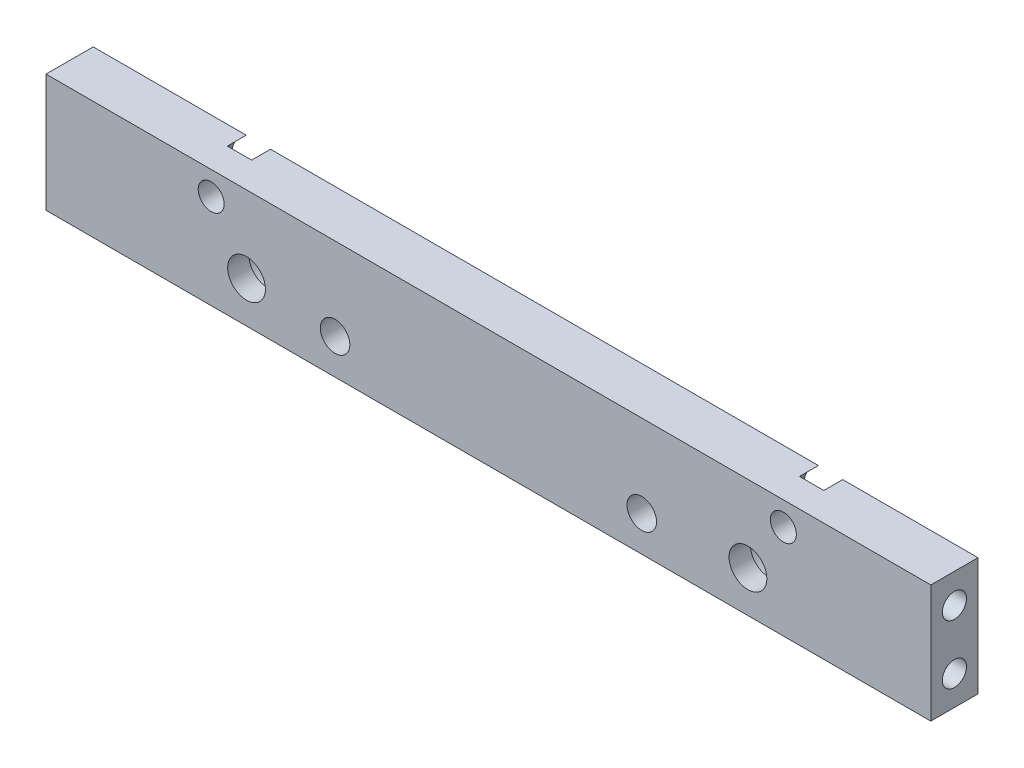
ISO-10303-21;
HEADER;
FILE_DESCRIPTION(('STEP AP214'),'2;1');
FILE_NAME('part.step','',(''),(''),'','','');
FILE_SCHEMA(('AUTOMOTIVE_DESIGN { 1 0 10303 214 1 1 1 1 }'));
ENDSEC;
DATA;
#1=APPLICATION_CONTEXT('core data for automotive mechanical design processes');
#2=APPLICATION_PROTOCOL_DEFINITION('international standard','automotive_design',2000,#1);
#3=PRODUCT_CONTEXT('',#1,'mechanical');
#4=PRODUCT('Part','Part','',(#3));
#5=PRODUCT_RELATED_PRODUCT_CATEGORY('part','',(#4));
#6=PRODUCT_DEFINITION_FORMATION('','',#4);
#7=PRODUCT_DEFINITION_CONTEXT('part definition',#1,'design');
#8=PRODUCT_DEFINITION('design','',#6,#7);
#9=PRODUCT_DEFINITION_SHAPE('','',#8);
#10=(LENGTH_UNIT() NAMED_UNIT(*) SI_UNIT(.MILLI.,.METRE.));
#11=(NAMED_UNIT(*) PLANE_ANGLE_UNIT() SI_UNIT($,.RADIAN.));
#12=(NAMED_UNIT(*) SI_UNIT($,.STERADIAN.) SOLID_ANGLE_UNIT());
#13=UNCERTAINTY_MEASURE_WITH_UNIT(LENGTH_MEASURE(1.E-05),#10,'distance_accuracy_value','');
#14=(GEOMETRIC_REPRESENTATION_CONTEXT(3) GLOBAL_UNCERTAINTY_ASSIGNED_CONTEXT((#13)) GLOBAL_UNIT_ASSIGNED_CONTEXT((#10,
#11,#12)) REPRESENTATION_CONTEXT('',''));
#15=CARTESIAN_POINT('',(0.,0.,0.));
#16=DIRECTION('',(0.,0.,1.));
#17=DIRECTION('',(1.,0.,0.));
#18=AXIS2_PLACEMENT_3D('',#15,#16,#17);
#19=CARTESIAN_POINT('',(-37.5,-5.,0.));
#20=DIRECTION('',(0.,-1.,0.));
#21=DIRECTION('',(0.,0.,-1.));
#22=AXIS2_PLACEMENT_3D('',#19,#20,#21);
#23=PLANE('',#22);
#24=DIRECTION('',(1.,0.,0.));
#25=VECTOR('',#24,1.);
#26=CARTESIAN_POINT('',(-37.5,-5.,4.));
#27=LINE('',#26,#25);
#28=CARTESIAN_POINT('',(-37.5,-5.,4.));
#29=VERTEX_POINT('',#28);
#30=CARTESIAN_POINT('',(37.5,-5.,4.));
#31=VERTEX_POINT('',#30);
#32=EDGE_CURVE('E200',#29,#31,#27,.T.);
#33=ORIENTED_EDGE('',*,*,#32,.F.);
#34=DIRECTION('',(0.,0.,1.));
#35=VECTOR('',#34,1.);
#36=CARTESIAN_POINT('',(-37.5,-5.,0.));
#37=LINE('',#36,#35);
#38=CARTESIAN_POINT('',(-37.5,-5.,0.));
#39=VERTEX_POINT('',#38);
#40=EDGE_CURVE('E227',#39,#29,#37,.T.);
#41=ORIENTED_EDGE('',*,*,#40,.F.);
#42=DIRECTION('',(1.,0.,0.));
#43=VECTOR('',#42,1.);
#44=CARTESIAN_POINT('',(-37.5,-5.,0.));
#45=LINE('',#44,#43);
#46=CARTESIAN_POINT('',(37.5,-5.,0.));
#47=VERTEX_POINT('',#46);
#48=EDGE_CURVE('E201',#39,#47,#45,.T.);
#49=ORIENTED_EDGE('',*,*,#48,.T.);
#50=DIRECTION('',(0.,0.,1.));
#51=VECTOR('',#50,1.);
#52=CARTESIAN_POINT('',(37.5,-5.,0.));
#53=LINE('',#52,#51);
#54=EDGE_CURVE('E216',#47,#31,#53,.T.);
#55=ORIENTED_EDGE('',*,*,#54,.T.);
#56=EDGE_LOOP('',(#33,#41,#49,#55));
#57=FACE_BOUND('',#56,.T.);
#58=ADVANCED_FACE('F32',(#57),#23,.T.);
#59=CARTESIAN_POINT('',(-37.5,5.,0.));
#60=DIRECTION('',(-1.,0.,0.));
#61=DIRECTION('',(0.,0.,1.));
#62=AXIS2_PLACEMENT_3D('',#59,#60,#61);
#63=PLANE('',#62);
#64=CARTESIAN_POINT('',(-37.5,-2.49999999999999,2.));
#65=DIRECTION('',(-1.,0.,0.));
#66=DIRECTION('',(0.,0.,1.));
#67=AXIS2_PLACEMENT_3D('',#64,#65,#66);
#68=CIRCLE('',#67,1.02499999999999);
#69=CARTESIAN_POINT('',(-37.5,-2.49999999999999,3.02499999999999));
#70=VERTEX_POINT('',#69);
#71=EDGE_CURVE('E118',#70,#70,#68,.T.);
#72=ORIENTED_EDGE('',*,*,#71,.F.);
#73=EDGE_LOOP('',(#72));
#74=FACE_BOUND('',#73,.T.);
#75=CARTESIAN_POINT('',(-37.5,2.50000000000001,2.));
#76=DIRECTION('',(-1.,0.,0.));
#77=DIRECTION('',(0.,0.,1.));
#78=AXIS2_PLACEMENT_3D('',#75,#76,#77);
#79=CIRCLE('',#78,1.02499999999999);
#80=CARTESIAN_POINT('',(-37.5,2.50000000000001,3.02499999999999));
#81=VERTEX_POINT('',#80);
#82=EDGE_CURVE('E117',#81,#81,#79,.T.);
#83=ORIENTED_EDGE('',*,*,#82,.F.);
#84=EDGE_LOOP('',(#83));
#85=FACE_BOUND('',#84,.T.);
#86=DIRECTION('',(0.,-1.,0.));
#87=VECTOR('',#86,1.);
#88=CARTESIAN_POINT('',(-37.5,5.,4.));
#89=LINE('',#88,#87);
#90=CARTESIAN_POINT('',(-37.5,5.,4.));
#91=VERTEX_POINT('',#90);
#92=EDGE_CURVE('E205',#91,#29,#89,.T.);
#93=ORIENTED_EDGE('',*,*,#92,.F.);
#94=DIRECTION('',(0.,0.,1.));
#95=VECTOR('',#94,1.);
#96=CARTESIAN_POINT('',(-37.5,5.,0.));
#97=LINE('',#96,#95);
#98=CARTESIAN_POINT('',(-37.5,5.,0.));
#99=VERTEX_POINT('',#98);
#100=EDGE_CURVE('E230',#99,#91,#97,.T.);
#101=ORIENTED_EDGE('',*,*,#100,.F.);
#102=DIRECTION('',(0.,-1.,0.));
#103=VECTOR('',#102,1.);
#104=CARTESIAN_POINT('',(-37.5,5.,0.));
#105=LINE('',#104,#103);
#106=EDGE_CURVE('E212',#99,#39,#105,.T.);
#107=ORIENTED_EDGE('',*,*,#106,.T.);
#108=ORIENTED_EDGE('',*,*,#40,.T.);
#109=EDGE_LOOP('',(#93,#101,#107,#108));
#110=FACE_BOUND('',#109,.T.);
#111=ADVANCED_FACE('F253',(#74,#85,#110),#63,.T.);
#112=CARTESIAN_POINT('',(37.5,5.,0.));
#113=DIRECTION('',(0.,1.,0.));
#114=DIRECTION('',(0.,0.,1.));
#115=AXIS2_PLACEMENT_3D('',#112,#113,#114);
#116=PLANE('',#115);
#117=DIRECTION('',(0.,0.,-1.));
#118=VECTOR('',#117,1.);
#119=CARTESIAN_POINT('',(-22.4692235967978,5.,0.));
#120=LINE('',#119,#118);
#121=CARTESIAN_POINT('',(-22.4692235967978,5.,1.6));
#122=VERTEX_POINT('',#121);
#123=CARTESIAN_POINT('',(-22.4692235967978,5.,0.));
#124=VERTEX_POINT('',#123);
#125=EDGE_CURVE('E46',#122,#124,#120,.T.);
#126=ORIENTED_EDGE('',*,*,#125,.F.);
#127=DIRECTION('',(1.,0.,0.));
#128=VECTOR('',#127,1.);
#129=CARTESIAN_POINT('',(37.5,5.,1.6));
#130=LINE('',#129,#128);
#131=CARTESIAN_POINT('',(-24.5307764032022,5.,1.6));
#132=VERTEX_POINT('',#131);
#133=EDGE_CURVE('E11',#132,#122,#130,.T.);
#134=ORIENTED_EDGE('',*,*,#133,.F.);
#135=DIRECTION('',(0.,0.,-1.));
#136=VECTOR('',#135,1.);
#137=CARTESIAN_POINT('',(-24.5307764032022,5.,0.));
#138=LINE('',#137,#136);
#139=CARTESIAN_POINT('',(-24.5307764032022,5.,0.));
#140=VERTEX_POINT('',#139);
#141=EDGE_CURVE('E149',#140,#132,#138,.F.);
#142=ORIENTED_EDGE('',*,*,#141,.F.);
#143=DIRECTION('',(-1.,0.,0.));
#144=VECTOR('',#143,1.);
#145=CARTESIAN_POINT('',(37.5,5.,0.));
#146=LINE('',#145,#144);
#147=EDGE_CURVE('E208',#140,#99,#146,.T.);
#148=ORIENTED_EDGE('',*,*,#147,.T.);
#149=ORIENTED_EDGE('',*,*,#100,.T.);
#150=DIRECTION('',(-1.,0.,0.));
#151=VECTOR('',#150,1.);
#152=CARTESIAN_POINT('',(37.5,5.,4.));
#153=LINE('',#152,#151);
#154=CARTESIAN_POINT('',(37.5,5.,4.));
#155=VERTEX_POINT('',#154);
#156=EDGE_CURVE('E222',#155,#91,#153,.T.);
#157=ORIENTED_EDGE('',*,*,#156,.F.);
#158=DIRECTION('',(0.,0.,1.));
#159=VECTOR('',#158,1.);
#160=CARTESIAN_POINT('',(37.5,5.,0.));
#161=LINE('',#160,#159);
#162=CARTESIAN_POINT('',(37.5,5.,0.));
#163=VERTEX_POINT('',#162);
#164=EDGE_CURVE('E232',#163,#155,#161,.T.);
#165=ORIENTED_EDGE('',*,*,#164,.F.);
#166=CARTESIAN_POINT('',(26.0307764032022,5.,0.));
#167=VERTEX_POINT('',#166);
#168=EDGE_CURVE('E209',#163,#167,#146,.T.);
#169=ORIENTED_EDGE('',*,*,#168,.T.);
#170=DIRECTION('',(0.,0.,-1.));
#171=VECTOR('',#170,1.);
#172=CARTESIAN_POINT('',(26.0307764032022,5.,0.));
#173=LINE('',#172,#171);
#174=CARTESIAN_POINT('',(26.0307764032022,5.,1.6));
#175=VERTEX_POINT('',#174);
#176=EDGE_CURVE('E54',#175,#167,#173,.T.);
#177=ORIENTED_EDGE('',*,*,#176,.F.);
#178=DIRECTION('',(1.,0.,0.));
#179=VECTOR('',#178,1.);
#180=CARTESIAN_POINT('',(37.5,5.,1.6));
#181=LINE('',#180,#179);
#182=CARTESIAN_POINT('',(23.9692235967978,5.,1.6));
#183=VERTEX_POINT('',#182);
#184=EDGE_CURVE('E236',#183,#175,#181,.T.);
#185=ORIENTED_EDGE('',*,*,#184,.F.);
#186=DIRECTION('',(0.,0.,-1.));
#187=VECTOR('',#186,1.);
#188=CARTESIAN_POINT('',(23.9692235967978,5.,0.));
#189=LINE('',#188,#187);
#190=CARTESIAN_POINT('',(23.9692235967978,5.,0.));
#191=VERTEX_POINT('',#190);
#192=EDGE_CURVE('E161',#191,#183,#189,.F.);
#193=ORIENTED_EDGE('',*,*,#192,.F.);
#194=EDGE_CURVE('E213',#191,#124,#146,.T.);
#195=ORIENTED_EDGE('',*,*,#194,.T.);
#196=EDGE_LOOP('',(#126,#134,#142,#148,#149,#157,#165,#169,#177,#185,#193,#195));
#197=FACE_BOUND('',#196,.T.);
#198=ADVANCED_FACE('F246',(#197),#116,.T.);
#199=CARTESIAN_POINT('',(37.5,-5.,0.));
#200=DIRECTION('',(1.,0.,0.));
#201=DIRECTION('',(0.,0.,-1.));
#202=AXIS2_PLACEMENT_3D('',#199,#200,#201);
#203=PLANE('',#202);
#204=CARTESIAN_POINT('',(37.5,2.50000000000001,2.));
#205=DIRECTION('',(1.,0.,0.));
#206=DIRECTION('',(0.,0.,-1.));
#207=AXIS2_PLACEMENT_3D('',#204,#205,#206);
#208=CIRCLE('',#207,1.02499999999999);
#209=CARTESIAN_POINT('',(37.5,2.50000000000001,0.975000000000011));
#210=VERTEX_POINT('',#209);
#211=EDGE_CURVE('E128',#210,#210,#208,.T.);
#212=ORIENTED_EDGE('',*,*,#211,.F.);
#213=EDGE_LOOP('',(#212));
#214=FACE_BOUND('',#213,.T.);
#215=CARTESIAN_POINT('',(37.5,-2.49999999999999,2.));
#216=DIRECTION('',(1.,0.,0.));
#217=DIRECTION('',(0.,0.,-1.));
#218=AXIS2_PLACEMENT_3D('',#215,#216,#217);
#219=CIRCLE('',#218,1.02499999999999);
#220=CARTESIAN_POINT('',(37.5,-2.49999999999999,0.975000000000011));
#221=VERTEX_POINT('',#220);
#222=EDGE_CURVE('E134',#221,#221,#219,.T.);
#223=ORIENTED_EDGE('',*,*,#222,.F.);
#224=EDGE_LOOP('',(#223));
#225=FACE_BOUND('',#224,.T.);
#226=DIRECTION('',(0.,1.,0.));
#227=VECTOR('',#226,1.);
#228=CARTESIAN_POINT('',(37.5,-5.,4.));
#229=LINE('',#228,#227);
#230=EDGE_CURVE('E219',#31,#155,#229,.T.);
#231=ORIENTED_EDGE('',*,*,#230,.F.);
#232=ORIENTED_EDGE('',*,*,#54,.F.);
#233=DIRECTION('',(0.,1.,0.));
#234=VECTOR('',#233,1.);
#235=CARTESIAN_POINT('',(37.5,-5.,0.));
#236=LINE('',#235,#234);
#237=EDGE_CURVE('E204',#47,#163,#236,.T.);
#238=ORIENTED_EDGE('',*,*,#237,.T.);
#239=ORIENTED_EDGE('',*,*,#164,.T.);
#240=EDGE_LOOP('',(#231,#232,#238,#239));
#241=FACE_BOUND('',#240,.T.);
#242=ADVANCED_FACE('F263',(#214,#225,#241),#203,.T.);
#243=CARTESIAN_POINT('',(0.,0.,0.));
#244=DIRECTION('',(0.,0.,1.));
#245=DIRECTION('',(1.,0.,0.));
#246=AXIS2_PLACEMENT_3D('',#243,#244,#245);
#247=PLANE('',#246);
#248=CARTESIAN_POINT('',(22.,-1.5,0.));
#249=DIRECTION('',(0.,0.,-1.));
#250=DIRECTION('',(-1.,0.,0.));
#251=AXIS2_PLACEMENT_3D('',#248,#249,#250);
#252=CIRCLE('',#251,2.89999999999999);
#253=CARTESIAN_POINT('',(19.1,-1.5,0.));
#254=VERTEX_POINT('',#253);
#255=EDGE_CURVE('E164',#254,#254,#252,.T.);
#256=ORIENTED_EDGE('',*,*,#255,.F.);
#257=EDGE_LOOP('',(#256));
#258=FACE_BOUND('',#257,.T.);
#259=CARTESIAN_POINT('',(-20.5,-1.5,0.));
#260=DIRECTION('',(0.,0.,-1.));
#261=DIRECTION('',(-1.,0.,0.));
#262=AXIS2_PLACEMENT_3D('',#259,#260,#261);
#263=CIRCLE('',#262,2.89999999999999);
#264=CARTESIAN_POINT('',(-23.4,-1.5,0.));
#265=VERTEX_POINT('',#264);
#266=EDGE_CURVE('E176',#265,#265,#263,.T.);
#267=ORIENTED_EDGE('',*,*,#266,.F.);
#268=EDGE_LOOP('',(#267));
#269=FACE_BOUND('',#268,.T.);
#270=CARTESIAN_POINT('',(13.,-2.,0.));
#271=DIRECTION('',(0.,0.,-1.));
#272=DIRECTION('',(-1.,0.,0.));
#273=AXIS2_PLACEMENT_3D('',#270,#271,#272);
#274=CIRCLE('',#273,1.24999999999999);
#275=CARTESIAN_POINT('',(11.75,-2.,0.));
#276=VERTEX_POINT('',#275);
#277=EDGE_CURVE('E188',#276,#276,#274,.T.);
#278=ORIENTED_EDGE('',*,*,#277,.F.);
#279=EDGE_LOOP('',(#278));
#280=FACE_BOUND('',#279,.T.);
#281=CARTESIAN_POINT('',(-13.,-2.,0.));
#282=DIRECTION('',(0.,0.,-1.));
#283=DIRECTION('',(-1.,0.,0.));
#284=AXIS2_PLACEMENT_3D('',#281,#282,#283);
#285=CIRCLE('',#284,1.24999999999999);
#286=CARTESIAN_POINT('',(-14.25,-2.,0.));
#287=VERTEX_POINT('',#286);
#288=EDGE_CURVE('E194',#287,#287,#285,.T.);
#289=ORIENTED_EDGE('',*,*,#288,.F.);
#290=EDGE_LOOP('',(#289));
#291=FACE_BOUND('',#290,.T.);
#292=ORIENTED_EDGE('',*,*,#147,.F.);
#293=CARTESIAN_POINT('',(-23.5,3.,0.));
#294=DIRECTION('',(0.,0.,1.));
#295=DIRECTION('',(1.,0.,0.));
#296=AXIS2_PLACEMENT_3D('',#293,#294,#295);
#297=CIRCLE('',#296,2.24999999853299);
#298=EDGE_CURVE('E39',#140,#124,#297,.T.);
#299=ORIENTED_EDGE('',*,*,#298,.T.);
#300=ORIENTED_EDGE('',*,*,#194,.F.);
#301=CARTESIAN_POINT('',(25.,3.,0.));
#302=DIRECTION('',(0.,0.,1.));
#303=DIRECTION('',(1.,0.,0.));
#304=AXIS2_PLACEMENT_3D('',#301,#302,#303);
#305=CIRCLE('',#304,2.24999999853299);
#306=EDGE_CURVE('E229',#191,#167,#305,.T.);
#307=ORIENTED_EDGE('',*,*,#306,.T.);
#308=ORIENTED_EDGE('',*,*,#168,.F.);
#309=ORIENTED_EDGE('',*,*,#237,.F.);
#310=ORIENTED_EDGE('',*,*,#48,.F.);
#311=ORIENTED_EDGE('',*,*,#106,.F.);
#312=EDGE_LOOP('',(#292,#299,#300,#307,#308,#309,#310,#311));
#313=FACE_BOUND('',#312,.T.);
#314=ADVANCED_FACE('F241',(#258,#269,#280,#291,#313),#247,.F.);
#315=CARTESIAN_POINT('',(0.,0.,4.));
#316=DIRECTION('',(0.,0.,1.));
#317=DIRECTION('',(1.,0.,0.));
#318=AXIS2_PLACEMENT_3D('',#315,#316,#317);
#319=PLANE('',#318);
#320=CARTESIAN_POINT('',(-23.5,3.,4.));
#321=DIRECTION('',(0.,0.,-1.));
#322=DIRECTION('',(-1.,0.,0.));
#323=AXIS2_PLACEMENT_3D('',#320,#321,#322);
#324=CIRCLE('',#323,1.10000000000001);
#325=CARTESIAN_POINT('',(-24.6,3.,4.));
#326=VERTEX_POINT('',#325);
#327=EDGE_CURVE('E146',#326,#326,#324,.T.);
#328=ORIENTED_EDGE('',*,*,#327,.T.);
#329=EDGE_LOOP('',(#328));
#330=FACE_BOUND('',#329,.T.);
#331=CARTESIAN_POINT('',(25.,3.,4.));
#332=DIRECTION('',(0.,0.,-1.));
#333=DIRECTION('',(-1.,0.,0.));
#334=AXIS2_PLACEMENT_3D('',#331,#332,#333);
#335=CIRCLE('',#334,1.10000000000001);
#336=CARTESIAN_POINT('',(23.9,3.,4.));
#337=VERTEX_POINT('',#336);
#338=EDGE_CURVE('E158',#337,#337,#335,.T.);
#339=ORIENTED_EDGE('',*,*,#338,.T.);
#340=EDGE_LOOP('',(#339));
#341=FACE_BOUND('',#340,.T.);
#342=CARTESIAN_POINT('',(22.,-1.5,4.));
#343=DIRECTION('',(0.,0.,-1.));
#344=DIRECTION('',(-1.,0.,0.));
#345=AXIS2_PLACEMENT_3D('',#342,#343,#344);
#346=CIRCLE('',#345,1.60000000000001);
#347=CARTESIAN_POINT('',(20.4,-1.5,4.));
#348=VERTEX_POINT('',#347);
#349=EDGE_CURVE('E173',#348,#348,#346,.T.);
#350=ORIENTED_EDGE('',*,*,#349,.T.);
#351=EDGE_LOOP('',(#350));
#352=FACE_BOUND('',#351,.T.);
#353=CARTESIAN_POINT('',(-20.5,-1.5,4.));
#354=DIRECTION('',(0.,0.,-1.));
#355=DIRECTION('',(-1.,0.,0.));
#356=AXIS2_PLACEMENT_3D('',#353,#354,#355);
#357=CIRCLE('',#356,1.60000000000001);
#358=CARTESIAN_POINT('',(-22.1,-1.5,4.));
#359=VERTEX_POINT('',#358);
#360=EDGE_CURVE('E185',#359,#359,#357,.T.);
#361=ORIENTED_EDGE('',*,*,#360,.T.);
#362=EDGE_LOOP('',(#361));
#363=FACE_BOUND('',#362,.T.);
#364=CARTESIAN_POINT('',(13.,-2.,4.));
#365=DIRECTION('',(0.,0.,-1.));
#366=DIRECTION('',(-1.,0.,0.));
#367=AXIS2_PLACEMENT_3D('',#364,#365,#366);
#368=CIRCLE('',#367,1.24999999999999);
#369=CARTESIAN_POINT('',(11.75,-2.,4.));
#370=VERTEX_POINT('',#369);
#371=EDGE_CURVE('E191',#370,#370,#368,.T.);
#372=ORIENTED_EDGE('',*,*,#371,.T.);
#373=EDGE_LOOP('',(#372));
#374=FACE_BOUND('',#373,.T.);
#375=CARTESIAN_POINT('',(-13.,-2.,4.));
#376=DIRECTION('',(0.,0.,-1.));
#377=DIRECTION('',(-1.,0.,0.));
#378=AXIS2_PLACEMENT_3D('',#375,#376,#377);
#379=CIRCLE('',#378,1.24999999999999);
#380=CARTESIAN_POINT('',(-14.25,-2.,4.));
#381=VERTEX_POINT('',#380);
#382=EDGE_CURVE('E197',#381,#381,#379,.T.);
#383=ORIENTED_EDGE('',*,*,#382,.T.);
#384=EDGE_LOOP('',(#383));
#385=FACE_BOUND('',#384,.T.);
#386=ORIENTED_EDGE('',*,*,#32,.T.);
#387=ORIENTED_EDGE('',*,*,#230,.T.);
#388=ORIENTED_EDGE('',*,*,#156,.T.);
#389=ORIENTED_EDGE('',*,*,#92,.T.);
#390=EDGE_LOOP('',(#386,#387,#388,#389));
#391=FACE_BOUND('',#390,.T.);
#392=ADVANCED_FACE('F261',(#330,#341,#352,#363,#374,#385,#391),#319,.T.);
#393=CARTESIAN_POINT('',(-13.,-2.,0.));
#394=DIRECTION('',(0.,0.,-1.));
#395=DIRECTION('',(-1.,0.,0.));
#396=AXIS2_PLACEMENT_3D('',#393,#394,#395);
#397=CYLINDRICAL_SURFACE('',#396,1.24999999999999);
#398=ORIENTED_EDGE('',*,*,#382,.F.);
#399=EDGE_LOOP('',(#398));
#400=FACE_BOUND('',#399,.T.);
#401=ORIENTED_EDGE('',*,*,#288,.T.);
#402=EDGE_LOOP('',(#401));
#403=FACE_BOUND('',#402,.T.);
#404=ADVANCED_FACE('F287',(#400,#403),#397,.F.);
#405=CARTESIAN_POINT('',(13.,-2.,0.));
#406=DIRECTION('',(0.,0.,-1.));
#407=DIRECTION('',(-1.,0.,0.));
#408=AXIS2_PLACEMENT_3D('',#405,#406,#407);
#409=CYLINDRICAL_SURFACE('',#408,1.24999999999999);
#410=ORIENTED_EDGE('',*,*,#371,.F.);
#411=EDGE_LOOP('',(#410));
#412=FACE_BOUND('',#411,.T.);
#413=ORIENTED_EDGE('',*,*,#277,.T.);
#414=EDGE_LOOP('',(#413));
#415=FACE_BOUND('',#414,.T.);
#416=ADVANCED_FACE('F292',(#412,#415),#409,.F.);
#417=CARTESIAN_POINT('',(-20.5,-1.5,0.));
#418=DIRECTION('',(0.,0.,-1.));
#419=DIRECTION('',(-1.,0.,0.));
#420=AXIS2_PLACEMENT_3D('',#417,#418,#419);
#421=CYLINDRICAL_SURFACE('',#420,1.60000000000001);
#422=ORIENTED_EDGE('',*,*,#360,.F.);
#423=EDGE_LOOP('',(#422));
#424=FACE_BOUND('',#423,.T.);
#425=CARTESIAN_POINT('',(-20.5,-1.5,2.2));
#426=DIRECTION('',(0.,0.,-1.));
#427=DIRECTION('',(-1.,0.,0.));
#428=AXIS2_PLACEMENT_3D('',#425,#426,#427);
#429=CIRCLE('',#428,1.60000000000001);
#430=CARTESIAN_POINT('',(-22.1,-1.5,2.2));
#431=VERTEX_POINT('',#430);
#432=EDGE_CURVE('E182',#431,#431,#429,.T.);
#433=ORIENTED_EDGE('',*,*,#432,.T.);
#434=EDGE_LOOP('',(#433));
#435=FACE_BOUND('',#434,.T.);
#436=ADVANCED_FACE('F296',(#424,#435),#421,.F.);
#437=CARTESIAN_POINT('',(-18.9,-1.5,2.2));
#438=DIRECTION('',(0.,0.,1.));
#439=DIRECTION('',(1.,0.,0.));
#440=AXIS2_PLACEMENT_3D('',#437,#438,#439);
#441=PLANE('',#440);
#442=ORIENTED_EDGE('',*,*,#432,.F.);
#443=EDGE_LOOP('',(#442));
#444=FACE_BOUND('',#443,.T.);
#445=CARTESIAN_POINT('',(-20.5,-1.5,2.2));
#446=DIRECTION('',(0.,0.,-1.));
#447=DIRECTION('',(-1.,0.,0.));
#448=AXIS2_PLACEMENT_3D('',#445,#446,#447);
#449=CIRCLE('',#448,2.89999999999999);
#450=CARTESIAN_POINT('',(-23.4,-1.5,2.2));
#451=VERTEX_POINT('',#450);
#452=EDGE_CURVE('E179',#451,#451,#449,.T.);
#453=ORIENTED_EDGE('',*,*,#452,.T.);
#454=EDGE_LOOP('',(#453));
#455=FACE_BOUND('',#454,.T.);
#456=ADVANCED_FACE('F300',(#444,#455),#441,.F.);
#457=CARTESIAN_POINT('',(-20.5,-1.5,0.));
#458=DIRECTION('',(0.,0.,-1.));
#459=DIRECTION('',(-1.,0.,0.));
#460=AXIS2_PLACEMENT_3D('',#457,#458,#459);
#461=CYLINDRICAL_SURFACE('',#460,2.89999999999999);
#462=ORIENTED_EDGE('',*,*,#452,.F.);
#463=EDGE_LOOP('',(#462));
#464=FACE_BOUND('',#463,.T.);
#465=ORIENTED_EDGE('',*,*,#266,.T.);
#466=EDGE_LOOP('',(#465));
#467=FACE_BOUND('',#466,.T.);
#468=ADVANCED_FACE('F304',(#464,#467),#461,.F.);
#469=CARTESIAN_POINT('',(22.,-1.5,0.));
#470=DIRECTION('',(0.,0.,-1.));
#471=DIRECTION('',(-1.,0.,0.));
#472=AXIS2_PLACEMENT_3D('',#469,#470,#471);
#473=CYLINDRICAL_SURFACE('',#472,1.60000000000001);
#474=ORIENTED_EDGE('',*,*,#349,.F.);
#475=EDGE_LOOP('',(#474));
#476=FACE_BOUND('',#475,.T.);
#477=CARTESIAN_POINT('',(22.,-1.5,2.2));
#478=DIRECTION('',(0.,0.,-1.));
#479=DIRECTION('',(-1.,0.,0.));
#480=AXIS2_PLACEMENT_3D('',#477,#478,#479);
#481=CIRCLE('',#480,1.60000000000001);
#482=CARTESIAN_POINT('',(20.4,-1.5,2.2));
#483=VERTEX_POINT('',#482);
#484=EDGE_CURVE('E170',#483,#483,#481,.T.);
#485=ORIENTED_EDGE('',*,*,#484,.T.);
#486=EDGE_LOOP('',(#485));
#487=FACE_BOUND('',#486,.T.);
#488=ADVANCED_FACE('F308',(#476,#487),#473,.F.);
#489=CARTESIAN_POINT('',(23.6,-1.5,2.2));
#490=DIRECTION('',(0.,0.,1.));
#491=DIRECTION('',(1.,0.,0.));
#492=AXIS2_PLACEMENT_3D('',#489,#490,#491);
#493=PLANE('',#492);
#494=ORIENTED_EDGE('',*,*,#484,.F.);
#495=EDGE_LOOP('',(#494));
#496=FACE_BOUND('',#495,.T.);
#497=CARTESIAN_POINT('',(22.,-1.5,2.2));
#498=DIRECTION('',(0.,0.,-1.));
#499=DIRECTION('',(-1.,0.,0.));
#500=AXIS2_PLACEMENT_3D('',#497,#498,#499);
#501=CIRCLE('',#500,2.89999999999999);
#502=CARTESIAN_POINT('',(19.1,-1.5,2.2));
#503=VERTEX_POINT('',#502);
#504=EDGE_CURVE('E167',#503,#503,#501,.T.);
#505=ORIENTED_EDGE('',*,*,#504,.T.);
#506=EDGE_LOOP('',(#505));
#507=FACE_BOUND('',#506,.T.);
#508=ADVANCED_FACE('F312',(#496,#507),#493,.F.);
#509=CARTESIAN_POINT('',(22.,-1.5,0.));
#510=DIRECTION('',(0.,0.,-1.));
#511=DIRECTION('',(-1.,0.,0.));
#512=AXIS2_PLACEMENT_3D('',#509,#510,#511);
#513=CYLINDRICAL_SURFACE('',#512,2.89999999999999);
#514=ORIENTED_EDGE('',*,*,#504,.F.);
#515=EDGE_LOOP('',(#514));
#516=FACE_BOUND('',#515,.T.);
#517=ORIENTED_EDGE('',*,*,#255,.T.);
#518=EDGE_LOOP('',(#517));
#519=FACE_BOUND('',#518,.T.);
#520=ADVANCED_FACE('F316',(#516,#519),#513,.F.);
#521=CARTESIAN_POINT('',(25.,3.,0.));
#522=DIRECTION('',(0.,0.,-1.));
#523=DIRECTION('',(-1.,0.,0.));
#524=AXIS2_PLACEMENT_3D('',#521,#522,#523);
#525=CYLINDRICAL_SURFACE('',#524,1.10000000000001);
#526=ORIENTED_EDGE('',*,*,#338,.F.);
#527=EDGE_LOOP('',(#526));
#528=FACE_BOUND('',#527,.T.);
#529=CARTESIAN_POINT('',(25.,3.,1.6));
#530=DIRECTION('',(0.,0.,-1.));
#531=DIRECTION('',(-1.,0.,0.));
#532=AXIS2_PLACEMENT_3D('',#529,#530,#531);
#533=CIRCLE('',#532,1.10000000000001);
#534=CARTESIAN_POINT('',(23.9,3.,1.6));
#535=VERTEX_POINT('',#534);
#536=EDGE_CURVE('E155',#535,#535,#533,.T.);
#537=ORIENTED_EDGE('',*,*,#536,.T.);
#538=EDGE_LOOP('',(#537));
#539=FACE_BOUND('',#538,.T.);
#540=ADVANCED_FACE('F320',(#528,#539),#525,.F.);
#541=CARTESIAN_POINT('',(26.1,3.,1.6));
#542=DIRECTION('',(0.,0.,1.));
#543=DIRECTION('',(1.,0.,0.));
#544=AXIS2_PLACEMENT_3D('',#541,#542,#543);
#545=PLANE('',#544);
#546=ORIENTED_EDGE('',*,*,#184,.T.);
#547=CARTESIAN_POINT('',(25.,3.,1.6));
#548=DIRECTION('',(0.,0.,-1.));
#549=DIRECTION('',(-1.,0.,0.));
#550=AXIS2_PLACEMENT_3D('',#547,#548,#549);
#551=CIRCLE('',#550,2.24999999853299);
#552=EDGE_CURVE('E152',#175,#183,#551,.T.);
#553=ORIENTED_EDGE('',*,*,#552,.T.);
#554=EDGE_LOOP('',(#546,#553));
#555=FACE_BOUND('',#554,.T.);
#556=ORIENTED_EDGE('',*,*,#536,.F.);
#557=EDGE_LOOP('',(#556));
#558=FACE_BOUND('',#557,.T.);
#559=ADVANCED_FACE('F324',(#555,#558),#545,.F.);
#560=CARTESIAN_POINT('',(25.,3.,0.));
#561=DIRECTION('',(0.,0.,-1.));
#562=DIRECTION('',(-1.,0.,0.));
#563=AXIS2_PLACEMENT_3D('',#560,#561,#562);
#564=CYLINDRICAL_SURFACE('',#563,2.24999999853299);
#565=ORIENTED_EDGE('',*,*,#176,.T.);
#566=ORIENTED_EDGE('',*,*,#306,.F.);
#567=ORIENTED_EDGE('',*,*,#192,.T.);
#568=ORIENTED_EDGE('',*,*,#552,.F.);
#569=EDGE_LOOP('',(#565,#566,#567,#568));
#570=FACE_BOUND('',#569,.T.);
#571=ADVANCED_FACE('F328',(#570),#564,.F.);
#572=CARTESIAN_POINT('',(-23.5,3.,0.));
#573=DIRECTION('',(0.,0.,-1.));
#574=DIRECTION('',(-1.,0.,0.));
#575=AXIS2_PLACEMENT_3D('',#572,#573,#574);
#576=CYLINDRICAL_SURFACE('',#575,1.10000000000001);
#577=ORIENTED_EDGE('',*,*,#327,.F.);
#578=EDGE_LOOP('',(#577));
#579=FACE_BOUND('',#578,.T.);
#580=CARTESIAN_POINT('',(-23.5,3.,1.6));
#581=DIRECTION('',(0.,0.,-1.));
#582=DIRECTION('',(-1.,0.,0.));
#583=AXIS2_PLACEMENT_3D('',#580,#581,#582);
#584=CIRCLE('',#583,1.10000000000001);
#585=CARTESIAN_POINT('',(-24.6,3.,1.6));
#586=VERTEX_POINT('',#585);
#587=EDGE_CURVE('E143',#586,#586,#584,.T.);
#588=ORIENTED_EDGE('',*,*,#587,.T.);
#589=EDGE_LOOP('',(#588));
#590=FACE_BOUND('',#589,.T.);
#591=ADVANCED_FACE('F332',(#579,#590),#576,.F.);
#592=CARTESIAN_POINT('',(-22.4,3.,1.6));
#593=DIRECTION('',(0.,0.,1.));
#594=DIRECTION('',(1.,0.,0.));
#595=AXIS2_PLACEMENT_3D('',#592,#593,#594);
#596=PLANE('',#595);
#597=ORIENTED_EDGE('',*,*,#133,.T.);
#598=CARTESIAN_POINT('',(-23.5,3.,1.6));
#599=DIRECTION('',(0.,0.,-1.));
#600=DIRECTION('',(-1.,0.,0.));
#601=AXIS2_PLACEMENT_3D('',#598,#599,#600);
#602=CIRCLE('',#601,2.24999999853299);
#603=EDGE_CURVE('E140',#122,#132,#602,.T.);
#604=ORIENTED_EDGE('',*,*,#603,.T.);
#605=EDGE_LOOP('',(#597,#604));
#606=FACE_BOUND('',#605,.T.);
#607=ORIENTED_EDGE('',*,*,#587,.F.);
#608=EDGE_LOOP('',(#607));
#609=FACE_BOUND('',#608,.T.);
#610=ADVANCED_FACE('F335',(#606,#609),#596,.F.);
#611=CARTESIAN_POINT('',(-23.5,3.,0.));
#612=DIRECTION('',(0.,0.,-1.));
#613=DIRECTION('',(-1.,0.,0.));
#614=AXIS2_PLACEMENT_3D('',#611,#612,#613);
#615=CYLINDRICAL_SURFACE('',#614,2.24999999853299);
#616=ORIENTED_EDGE('',*,*,#125,.T.);
#617=ORIENTED_EDGE('',*,*,#298,.F.);
#618=ORIENTED_EDGE('',*,*,#141,.T.);
#619=ORIENTED_EDGE('',*,*,#603,.F.);
#620=EDGE_LOOP('',(#616,#617,#618,#619));
#621=FACE_BOUND('',#620,.T.);
#622=ADVANCED_FACE('F339',(#621),#615,.F.);
#623=CARTESIAN_POINT('',(29.5,-2.49999999999999,2.));
#624=DIRECTION('',(1.,0.,0.));
#625=DIRECTION('',(0.,0.,-1.));
#626=AXIS2_PLACEMENT_3D('',#623,#624,#625);
#627=CONICAL_SURFACE('',#626,1.02499999999999,1.02974425832057);
#628=CARTESIAN_POINT('',(28.884117865,-2.49999999999999,2.));
#629=VERTEX_POINT('',#628);
#630=VERTEX_LOOP('',#629);
#631=FACE_BOUND('',#630,.T.);
#632=CARTESIAN_POINT('',(29.5,-2.49999999999999,2.));
#633=DIRECTION('',(1.,0.,0.));
#634=DIRECTION('',(0.,0.,-1.));
#635=AXIS2_PLACEMENT_3D('',#632,#633,#634);
#636=CIRCLE('',#635,1.02499999999999);
#637=CARTESIAN_POINT('',(29.5,-2.49999999999999,0.975000000000012));
#638=VERTEX_POINT('',#637);
#639=EDGE_CURVE('E137',#638,#638,#636,.T.);
#640=ORIENTED_EDGE('',*,*,#639,.T.);
#641=EDGE_LOOP('',(#640));
#642=FACE_BOUND('',#641,.T.);
#643=ADVANCED_FACE('F343',(#631,#642),#627,.F.);
#644=CARTESIAN_POINT('',(37.5,-2.49999999999999,2.));
#645=DIRECTION('',(1.,0.,0.));
#646=DIRECTION('',(0.,0.,-1.));
#647=AXIS2_PLACEMENT_3D('',#644,#645,#646);
#648=CYLINDRICAL_SURFACE('',#647,1.02499999999999);
#649=ORIENTED_EDGE('',*,*,#639,.F.);
#650=EDGE_LOOP('',(#649));
#651=FACE_BOUND('',#650,.T.);
#652=ORIENTED_EDGE('',*,*,#222,.T.);
#653=EDGE_LOOP('',(#652));
#654=FACE_BOUND('',#653,.T.);
#655=ADVANCED_FACE('F346',(#651,#654),#648,.F.);
#656=CARTESIAN_POINT('',(29.5,2.50000000000001,2.));
#657=DIRECTION('',(1.,0.,0.));
#658=DIRECTION('',(0.,0.,-1.));
#659=AXIS2_PLACEMENT_3D('',#656,#657,#658);
#660=CONICAL_SURFACE('',#659,1.02499999999999,1.02974425832057);
#661=CARTESIAN_POINT('',(28.884117865,2.50000000000001,2.));
#662=VERTEX_POINT('',#661);
#663=VERTEX_LOOP('',#662);
#664=FACE_BOUND('',#663,.T.);
#665=CARTESIAN_POINT('',(29.5,2.50000000000001,2.));
#666=DIRECTION('',(1.,0.,0.));
#667=DIRECTION('',(0.,0.,-1.));
#668=AXIS2_PLACEMENT_3D('',#665,#666,#667);
#669=CIRCLE('',#668,1.02499999999999);
#670=CARTESIAN_POINT('',(29.5,2.50000000000001,0.975000000000012));
#671=VERTEX_POINT('',#670);
#672=EDGE_CURVE('E131',#671,#671,#669,.T.);
#673=ORIENTED_EDGE('',*,*,#672,.T.);
#674=EDGE_LOOP('',(#673));
#675=FACE_BOUND('',#674,.T.);
#676=ADVANCED_FACE('F350',(#664,#675),#660,.F.);
#677=CARTESIAN_POINT('',(37.5,2.50000000000001,2.));
#678=DIRECTION('',(1.,0.,0.));
#679=DIRECTION('',(0.,0.,-1.));
#680=AXIS2_PLACEMENT_3D('',#677,#678,#679);
#681=CYLINDRICAL_SURFACE('',#680,1.02499999999999);
#682=ORIENTED_EDGE('',*,*,#672,.F.);
#683=EDGE_LOOP('',(#682));
#684=FACE_BOUND('',#683,.T.);
#685=ORIENTED_EDGE('',*,*,#211,.T.);
#686=EDGE_LOOP('',(#685));
#687=FACE_BOUND('',#686,.T.);
#688=ADVANCED_FACE('F354',(#684,#687),#681,.F.);
#689=CARTESIAN_POINT('',(-29.5,2.50000000000001,2.));
#690=DIRECTION('',(-1.,0.,0.));
#691=DIRECTION('',(0.,0.,1.));
#692=AXIS2_PLACEMENT_3D('',#689,#690,#691);
#693=CONICAL_SURFACE('',#692,1.02499999999999,1.02974425832057);
#694=CARTESIAN_POINT('',(-28.884117865,2.50000000000001,2.));
#695=VERTEX_POINT('',#694);
#696=VERTEX_LOOP('',#695);
#697=FACE_BOUND('',#696,.T.);
#698=CARTESIAN_POINT('',(-29.5,2.50000000000001,2.));
#699=DIRECTION('',(-1.,0.,0.));
#700=DIRECTION('',(0.,0.,1.));
#701=AXIS2_PLACEMENT_3D('',#698,#699,#700);
#702=CIRCLE('',#701,1.02499999999999);
#703=CARTESIAN_POINT('',(-29.5,2.50000000000001,3.02499999999999));
#704=VERTEX_POINT('',#703);
#705=EDGE_CURVE('E121',#704,#704,#702,.T.);
#706=ORIENTED_EDGE('',*,*,#705,.T.);
#707=EDGE_LOOP('',(#706));
#708=FACE_BOUND('',#707,.T.);
#709=ADVANCED_FACE('F358',(#697,#708),#693,.F.);
#710=CARTESIAN_POINT('',(-37.5,2.50000000000001,2.));
#711=DIRECTION('',(-1.,0.,0.));
#712=DIRECTION('',(0.,0.,1.));
#713=AXIS2_PLACEMENT_3D('',#710,#711,#712);
#714=CYLINDRICAL_SURFACE('',#713,1.02499999999999);
#715=ORIENTED_EDGE('',*,*,#705,.F.);
#716=EDGE_LOOP('',(#715));
#717=FACE_BOUND('',#716,.T.);
#718=ORIENTED_EDGE('',*,*,#82,.T.);
#719=EDGE_LOOP('',(#718));
#720=FACE_BOUND('',#719,.T.);
#721=ADVANCED_FACE('F111',(#717,#720),#714,.F.);
#722=CARTESIAN_POINT('',(-29.5,-2.49999999999999,2.));
#723=DIRECTION('',(-1.,0.,0.));
#724=DIRECTION('',(0.,0.,1.));
#725=AXIS2_PLACEMENT_3D('',#722,#723,#724);
#726=CONICAL_SURFACE('',#725,1.02499999999999,1.02974425832057);
#727=CARTESIAN_POINT('',(-28.884117865,-2.49999999999999,2.));
#728=VERTEX_POINT('',#727);
#729=VERTEX_LOOP('',#728);
#730=FACE_BOUND('',#729,.T.);
#731=CARTESIAN_POINT('',(-29.5,-2.49999999999999,2.));
#732=DIRECTION('',(-1.,0.,0.));
#733=DIRECTION('',(0.,0.,1.));
#734=AXIS2_PLACEMENT_3D('',#731,#732,#733);
#735=CIRCLE('',#734,1.02499999999999);
#736=CARTESIAN_POINT('',(-29.5,-2.49999999999999,3.02499999999999));
#737=VERTEX_POINT('',#736);
#738=EDGE_CURVE('E115',#737,#737,#735,.T.);
#739=ORIENTED_EDGE('',*,*,#738,.T.);
#740=EDGE_LOOP('',(#739));
#741=FACE_BOUND('',#740,.T.);
#742=ADVANCED_FACE('F107',(#730,#741),#726,.F.);
#743=CARTESIAN_POINT('',(-37.5,-2.49999999999999,2.));
#744=DIRECTION('',(-1.,0.,0.));
#745=DIRECTION('',(0.,0.,1.));
#746=AXIS2_PLACEMENT_3D('',#743,#744,#745);
#747=CYLINDRICAL_SURFACE('',#746,1.02499999999999);
#748=ORIENTED_EDGE('',*,*,#738,.F.);
#749=EDGE_LOOP('',(#748));
#750=FACE_BOUND('',#749,.T.);
#751=ORIENTED_EDGE('',*,*,#71,.T.);
#752=EDGE_LOOP('',(#751));
#753=FACE_BOUND('',#752,.T.);
#754=ADVANCED_FACE('F110',(#750,#753),#747,.F.);
#755=CLOSED_SHELL('',(#58,#111,#198,#242,#314,#392,#404,#416,#436,#456,#468,#488,#508,#520,#540,
#559,#571,#591,#610,#622,#643,#655,#676,#688,#709,#721,#742,#754));
#756=MANIFOLD_SOLID_BREP('B2',#755);
#757=ADVANCED_BREP_SHAPE_REPRESENTATION('',(#18,#756),#14);
#758=SHAPE_DEFINITION_REPRESENTATION(#9,#757);
ENDSEC;
END-ISO-10303-21;
